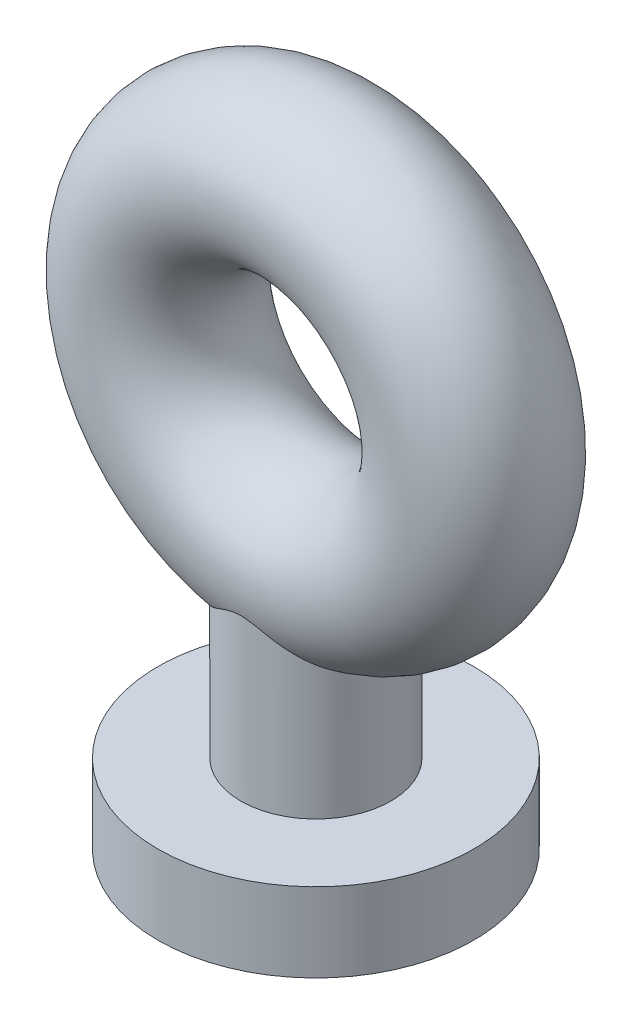
ISO-10303-21;
HEADER;
FILE_DESCRIPTION(('STEP AP214'),'2;1');
FILE_NAME('part.step','',(''),(''),'','','');
FILE_SCHEMA(('AUTOMOTIVE_DESIGN { 1 0 10303 214 1 1 1 1 }'));
ENDSEC;
DATA;
#1=APPLICATION_CONTEXT('core data for automotive mechanical design processes');
#2=APPLICATION_PROTOCOL_DEFINITION('international standard','automotive_design',2000,#1);
#3=PRODUCT_CONTEXT('',#1,'mechanical');
#4=PRODUCT('Part','Part','',(#3));
#5=PRODUCT_RELATED_PRODUCT_CATEGORY('part','',(#4));
#6=PRODUCT_DEFINITION_FORMATION('','',#4);
#7=PRODUCT_DEFINITION_CONTEXT('part definition',#1,'design');
#8=PRODUCT_DEFINITION('design','',#6,#7);
#9=PRODUCT_DEFINITION_SHAPE('','',#8);
#10=(LENGTH_UNIT() NAMED_UNIT(*) SI_UNIT(.MILLI.,.METRE.));
#11=(NAMED_UNIT(*) PLANE_ANGLE_UNIT() SI_UNIT($,.RADIAN.));
#12=(NAMED_UNIT(*) SI_UNIT($,.STERADIAN.) SOLID_ANGLE_UNIT());
#13=UNCERTAINTY_MEASURE_WITH_UNIT(LENGTH_MEASURE(1.E-05),#10,'distance_accuracy_value','');
#14=(GEOMETRIC_REPRESENTATION_CONTEXT(3) GLOBAL_UNCERTAINTY_ASSIGNED_CONTEXT((#13)) GLOBAL_UNIT_ASSIGNED_CONTEXT((#10,
#11,#12)) REPRESENTATION_CONTEXT('',''));
#15=CARTESIAN_POINT('',(0.,0.,0.));
#16=DIRECTION('',(0.,0.,1.));
#17=DIRECTION('',(1.,0.,0.));
#18=AXIS2_PLACEMENT_3D('',#15,#16,#17);
#19=CARTESIAN_POINT('',(0.,0.,0.));
#20=DIRECTION('',(0.,1.,0.));
#21=DIRECTION('',(0.,0.,1.));
#22=AXIS2_PLACEMENT_3D('',#19,#20,#21);
#23=CYLINDRICAL_SURFACE('',#22,0.95);
#24=CARTESIAN_POINT('',(0.,-4.34561065502644,0.));
#25=DIRECTION('',(0.,1.,0.));
#26=DIRECTION('',(0.,0.,1.));
#27=AXIS2_PLACEMENT_3D('',#24,#25,#26);
#28=CIRCLE('',#27,0.95);
#29=CARTESIAN_POINT('',(0.,-4.34561065502644,0.95));
#30=VERTEX_POINT('',#29);
#31=EDGE_CURVE('E66',#30,#30,#28,.T.);
#32=ORIENTED_EDGE('',*,*,#31,.T.);
#33=EDGE_LOOP('',(#32));
#34=FACE_BOUND('',#33,.T.);
#35=CARTESIAN_POINT('',(-0.686107709889865,-2.66697916564498,-0.657081585827656));
#36=CARTESIAN_POINT('',(-0.718537566607442,-2.68911585756236,-0.62321740716849));
#37=CARTESIAN_POINT('',(-0.748933624272086,-2.709846643404,-0.58645768139276));
#38=CARTESIAN_POINT('',(-0.804545566993137,-2.74766569107918,-0.507481258633035));
#39=CARTESIAN_POINT('',(-0.829760471885721,-2.76475326371729,-0.465263531567923));
#40=CARTESIAN_POINT('',(-0.873917071789901,-2.79458444290419,-0.375856493314437));
#41=CARTESIAN_POINT('',(-0.892818750301128,-2.80730035394375,-0.328637877621803));
#42=CARTESIAN_POINT('',(-0.922965017709951,-2.82753746176673,-0.230762976150301));
#43=CARTESIAN_POINT('',(-0.934215061369649,-2.83506235921848,-0.180109167670075));
#44=CARTESIAN_POINT('',(-0.947611692614304,-2.84401752924975,-0.0820978358374224));
#45=CARTESIAN_POINT('',(-0.950529917833294,-2.84596446469983,-0.034891980640852));
#46=CARTESIAN_POINT('',(-0.949312268133808,-2.84515147387259,0.0593801343468794));
#47=CARTESIAN_POINT('',(-0.94517853724194,-2.84239297820113,0.106446432210107));
#48=CARTESIAN_POINT('',(-0.93052733528911,-2.83259435208319,0.19642931015539));
#49=CARTESIAN_POINT('',(-0.920370112695916,-2.82579580197874,0.239432243088445));
#50=CARTESIAN_POINT('',(-0.894501131004106,-2.80842944054598,0.322922066097443));
#51=CARTESIAN_POINT('',(-0.878788485188182,-2.79786102749646,0.363408553302471));
#52=CARTESIAN_POINT('',(-0.841601052676448,-2.77276158488804,0.442981243326131));
#53=CARTESIAN_POINT('',(-0.819877221924564,-2.75805869394902,0.481895931285567));
#54=CARTESIAN_POINT('',(-0.77197775437424,-2.72553240879966,0.555407176759852));
#55=CARTESIAN_POINT('',(-0.745801675436277,-2.70770870466547,0.590003304819153));
#56=CARTESIAN_POINT('',(-0.686149858018138,-2.66701357329722,0.658814829395224));
#57=CARTESIAN_POINT('',(-0.65216670443968,-2.6437864489379,0.692378328853285));
#58=CARTESIAN_POINT('',(-0.580549306918772,-2.59501396118295,0.753447126679248));
#59=CARTESIAN_POINT('',(-0.542908518304331,-2.56946444777049,0.780941266475152));
#60=CARTESIAN_POINT('',(-0.457147579908317,-2.51208702437647,0.834599060964194));
#61=CARTESIAN_POINT('',(-0.408402536433583,-2.47999512268415,0.859495054736874));
#62=CARTESIAN_POINT('',(-0.332058078263538,-2.4330660717982,0.890499007206581));
#63=CARTESIAN_POINT('',(-0.306068795850057,-2.41762274018641,0.899777718251571));
#64=CARTESIAN_POINT('',(-0.252738055109097,-2.38800945576208,0.916188939007451));
#65=CARTESIAN_POINT('',(-0.225398833046407,-2.37383749974889,0.923324868103249));
#66=CARTESIAN_POINT('',(-0.174304106935673,-2.35073319964663,0.934164805276011));
#67=CARTESIAN_POINT('',(-0.150858719197372,-2.34131702906078,0.938263699218337));
#68=CARTESIAN_POINT('',(-0.102733743757806,-2.32582300358585,0.944736814862489));
#69=CARTESIAN_POINT('',(-0.0780628745748964,-2.31972446470495,0.947121752996518));
#70=CARTESIAN_POINT('',(-0.0329336264870515,-2.3132154376222,0.949640266422268));
#71=CARTESIAN_POINT('',(-0.0126331849692011,-2.31190358363882,0.950131791027877));
#72=CARTESIAN_POINT('',(0.0278935476821042,-2.31275746191911,0.949806924307897));
#73=CARTESIAN_POINT('',(0.0481197693875242,-2.314925882471,0.948989521921514));
#74=CARTESIAN_POINT('',(0.0950063807282495,-2.32352392858396,0.945625583909768));
#75=CARTESIAN_POINT('',(0.121388094779943,-2.3311977162213,0.94256623098359));
#76=CARTESIAN_POINT('',(0.172706872358861,-2.34985671198843,0.934534785433899));
#77=CARTESIAN_POINT('',(0.197634437156338,-2.36086129476586,0.929551453317192));
#78=CARTESIAN_POINT('',(0.248349617539811,-2.38563023051673,0.917365662539067));
#79=CARTESIAN_POINT('',(0.274020232020431,-2.39955214113389,0.910006646308973));
#80=CARTESIAN_POINT('',(0.324201981170281,-2.42832082503176,0.893359700895082));
#81=CARTESIAN_POINT('',(0.348711921925365,-2.44316851574397,0.884069836305237));
#82=CARTESIAN_POINT('',(0.420782987170241,-2.4880939678893,0.853331951435133));
#83=CARTESIAN_POINT('',(0.466907877644475,-2.51856665439152,0.829010072969224));
#84=CARTESIAN_POINT('',(0.559820122043784,-2.58083537287273,0.769694428223354));
#85=CARTESIAN_POINT('',(0.606200630870285,-2.61245240465935,0.733868764574627));
#86=CARTESIAN_POINT('',(0.692824048253674,-2.67155473053028,0.652686300022467));
#87=CARTESIAN_POINT('',(0.733079595183192,-2.69904853084541,0.607349597483811));
#88=CARTESIAN_POINT('',(0.796324109695874,-2.74208489668164,0.520105583081177));
#89=CARTESIAN_POINT('',(0.821119872749063,-2.75890073983021,0.480132201365907));
#90=CARTESIAN_POINT('',(0.86494586277568,-2.78853383868721,0.395757254936515));
#91=CARTESIAN_POINT('',(0.88397851996293,-2.80135277989615,0.351357567256267));
#92=CARTESIAN_POINT('',(0.915339581250593,-2.82242650242287,0.258932874995945));
#93=CARTESIAN_POINT('',(0.927632631071112,-2.83065721878391,0.210890229639261));
#94=CARTESIAN_POINT('',(0.944576988294849,-2.84199169683335,0.112886150105302));
#95=CARTESIAN_POINT('',(0.949231497026413,-2.84509760634187,0.0629255287447833));
#96=CARTESIAN_POINT('',(0.950531281660707,-2.84596531859667,-0.0325672228778721));
#97=CARTESIAN_POINT('',(0.9478683429508,-2.8441887086632,-0.0780876497965773));
#98=CARTESIAN_POINT('',(0.936139760638801,-2.83634928015792,-0.167907199337748));
#99=CARTESIAN_POINT('',(0.92707494590178,-2.83028701645911,-0.212206479293422));
#100=CARTESIAN_POINT('',(0.903172229014971,-2.81425546266319,-0.297887147397901));
#101=CARTESIAN_POINT('',(0.888402228415573,-2.80433211631884,-0.339296331717671));
#102=CARTESIAN_POINT('',(0.853779386089171,-2.78099058911118,-0.418861450588534));
#103=CARTESIAN_POINT('',(0.833925436404145,-2.76757164643258,-0.45701667357622));
#104=CARTESIAN_POINT('',(0.78802969386382,-2.73644666900796,-0.53256648242481));
#105=CARTESIAN_POINT('',(0.761603201103364,-2.71847162958032,-0.569615076686188));
#106=CARTESIAN_POINT('',(0.704662231442675,-2.67965185071339,-0.63871670085388));
#107=CARTESIAN_POINT('',(0.674145545881099,-2.65880556065958,-0.670767011366385));
#108=CARTESIAN_POINT('',(0.604774037047056,-2.61148681444532,-0.734370935053981));
#109=CARTESIAN_POINT('',(0.565364143147593,-2.5846462257675,-0.765041633791913));
#110=CARTESIAN_POINT('',(0.483082729811177,-2.52933035172843,-0.819495889955601));
#111=CARTESIAN_POINT('',(0.44020966369474,-2.50085433763272,-0.84327634815584));
#112=CARTESIAN_POINT('',(0.364330504970579,-2.45268595555276,-0.878038724732465));
#113=CARTESIAN_POINT('',(0.33215579196566,-2.43288631265247,-0.890725820484923));
#114=CARTESIAN_POINT('',(0.265757628554085,-2.39480970091007,-0.91274293080887));
#115=CARTESIAN_POINT('',(0.231535453340861,-2.37653180092346,-0.922075010067865));
#116=CARTESIAN_POINT('',(0.17459131656142,-2.3509131037208,-0.934071328974879));
#117=CARTESIAN_POINT('',(0.152783220978903,-2.34213090276924,-0.937907597991207));
#118=CARTESIAN_POINT('',(0.108056517696482,-2.32737405135911,-0.944102670472761));
#119=CARTESIAN_POINT('',(0.0851422382433093,-2.32138930418871,-0.946466797696264));
#120=CARTESIAN_POINT('',(0.0421954911207585,-2.31420215449543,-0.949265142345696));
#121=CARTESIAN_POINT('',(0.0222876901518615,-2.31238833402715,-0.949947399555592));
#122=CARTESIAN_POINT('',(-0.0175430524761697,-2.31212705526616,-0.950046676352715));
#123=CARTESIAN_POINT('',(-0.0374659785268291,-2.31367763368445,-0.949464433836329));
#124=CARTESIAN_POINT('',(-0.0828215436415344,-2.32071545130531,-0.946733973930807));
#125=CARTESIAN_POINT('',(-0.108052963332829,-2.32727170657965,-0.944157204763681));
#126=CARTESIAN_POINT('',(-0.157223051564801,-2.34370817933205,-0.937232896542781));
#127=CARTESIAN_POINT('',(-0.181152741465283,-2.35360874060347,-0.932874484603572));
#128=CARTESIAN_POINT('',(-0.229531457925854,-2.37603007373635,-0.922210830958316));
#129=CARTESIAN_POINT('',(-0.253886556734947,-2.38869102640573,-0.915784824860382));
#130=CARTESIAN_POINT('',(-0.301511158657324,-2.41505181474435,-0.901227386574602));
#131=CARTESIAN_POINT('',(-0.324779443659983,-2.42875277297033,-0.893094094381388));
#132=CARTESIAN_POINT('',(-0.393218569955852,-2.47041518123862,-0.86619096197211));
#133=CARTESIAN_POINT('',(-0.437073704434972,-2.4989628445536,-0.8449064452122));
#134=CARTESIAN_POINT('',(-0.516655572466352,-2.55177574707213,-0.798393334811907));
#135=CARTESIAN_POINT('',(-0.552737605492107,-2.5761565272753,-0.773897449215022));
#136=CARTESIAN_POINT('',(-0.621873929286447,-2.62311675046395,-0.719517343842048));
#137=CARTESIAN_POINT('',(-0.654930667972384,-2.64569764788088,-0.689637539643686));
#138=CARTESIAN_POINT('',(-0.686107709889865,-2.66697916564498,-0.657081585827656));
#139=B_SPLINE_CURVE_WITH_KNOTS('',3,(#35,#36,#37,#38,#39,#40,#41,#42,#43,#44,#45,#46,#47,#48,
#49,#50,#51,#52,#53,#54,#55,#56,#57,#58,#59,#60,#61,#62,#63,#64,#65,#66,#67,#68,#69,#70,#71,#72,
#73,#74,#75,#76,#77,#78,#79,#80,#81,#82,#83,#84,#85,#86,#87,#88,#89,#90,#91,#92,#93,#94,#95,#96,
#97,#98,#99,#100,#101,#102,#103,#104,#105,#106,#107,#108,#109,#110,#111,#112,#113,#114,#115,
#116,#117,#118,#119,#120,#121,#122,#123,#124,#125,#126,#127,#128,#129,#130,#131,#132,#133,#134,
#135,#136,#137,#138),.UNSPECIFIED.,.T.,.F.,(4,2,2,2,2,2,2,2,2,2,2,2,2,2,2,2,2,2,2,2,2,2,2,2,2,2,
2,2,2,2,2,2,2,2,2,2,2,2,2,2,2,2,2,2,2,2,2,2,2,2,2,4),(0.,0.155414593700593,0.310858561520415,
0.46726990080216,0.623569619045127,0.764833349134726,0.906054138057857,1.03957722827315,
1.17312164012668,1.31335024058479,1.45359277486736,1.61233018112952,1.77135704090581,
1.96089917914539,2.05569301372248,2.15033476537958,2.22693802253045,2.30305805267902,
2.36377291126995,2.4245346907589,2.50697218941158,2.58989874138626,2.68011451335322,
2.77042115395856,2.9509560467706,3.14979228779157,3.34821251336579,3.49746587251359,
3.64665620586651,3.79662184306225,3.94652461328408,4.08275505857397,4.2189678690391,
4.35360712277879,4.48827574380493,4.63449605601793,4.78079564619079,4.95027015382355,
5.11982077305467,5.23923212697527,5.35856986847866,5.42988535721948,5.50094142423115,
5.56064208758023,5.62030792208319,5.69842329518862,5.77702267646738,5.86147261487843,
5.94601503939041,6.11492788578724,6.26446066130362,6.41387135234024),.UNSPECIFIED.);
#140=CARTESIAN_POINT('',(-0.686107709889865,-2.66697916564498,-0.657081585827656));
#141=VERTEX_POINT('',#140);
#142=EDGE_CURVE('E10',#141,#141,#139,.T.);
#143=ORIENTED_EDGE('',*,*,#142,.F.);
#144=EDGE_LOOP('',(#143));
#145=FACE_BOUND('',#144,.T.);
#146=ADVANCED_FACE('F43',(#34,#145),#23,.T.);
#147=CARTESIAN_POINT('',(0.,-5.34561065502644,0.));
#148=DIRECTION('',(0.,-1.,0.));
#149=DIRECTION('',(0.,0.,-1.));
#150=AXIS2_PLACEMENT_3D('',#147,#148,#149);
#151=PLANE('',#150);
#152=CARTESIAN_POINT('',(0.,-5.34561065502644,0.));
#153=DIRECTION('',(0.,1.,0.));
#154=DIRECTION('',(0.,0.,1.));
#155=AXIS2_PLACEMENT_3D('',#152,#153,#154);
#156=CIRCLE('',#155,2.);
#157=CARTESIAN_POINT('',(0.,-5.34561065502644,2.));
#158=VERTEX_POINT('',#157);
#159=EDGE_CURVE('E56',#158,#158,#156,.T.);
#160=ORIENTED_EDGE('',*,*,#159,.F.);
#161=EDGE_LOOP('',(#160));
#162=FACE_BOUND('',#161,.T.);
#163=ADVANCED_FACE('F84',(#162),#151,.T.);
#164=CARTESIAN_POINT('',(0.,0.,0.));
#165=DIRECTION('',(0.,1.,0.));
#166=DIRECTION('',(0.,0.,1.));
#167=AXIS2_PLACEMENT_3D('',#164,#165,#166);
#168=CYLINDRICAL_SURFACE('',#167,2.);
#169=ORIENTED_EDGE('',*,*,#159,.T.);
#170=EDGE_LOOP('',(#169));
#171=FACE_BOUND('',#170,.T.);
#172=CARTESIAN_POINT('',(0.,-4.34561065502644,0.));
#173=DIRECTION('',(0.,1.,0.));
#174=DIRECTION('',(0.,0.,1.));
#175=AXIS2_PLACEMENT_3D('',#172,#173,#174);
#176=CIRCLE('',#175,2.);
#177=CARTESIAN_POINT('',(0.,-4.34561065502644,2.));
#178=VERTEX_POINT('',#177);
#179=EDGE_CURVE('E61',#178,#178,#176,.T.);
#180=ORIENTED_EDGE('',*,*,#179,.F.);
#181=EDGE_LOOP('',(#180));
#182=FACE_BOUND('',#181,.T.);
#183=ADVANCED_FACE('F77',(#171,#182),#168,.T.);
#184=CARTESIAN_POINT('',(0.,-4.34561065502644,0.));
#185=DIRECTION('',(0.,1.,0.));
#186=DIRECTION('',(0.,0.,1.));
#187=AXIS2_PLACEMENT_3D('',#184,#185,#186);
#188=PLANE('',#187);
#189=ORIENTED_EDGE('',*,*,#179,.T.);
#190=EDGE_LOOP('',(#189));
#191=FACE_BOUND('',#190,.T.);
#192=ORIENTED_EDGE('',*,*,#31,.F.);
#193=EDGE_LOOP('',(#192));
#194=FACE_BOUND('',#193,.T.);
#195=ADVANCED_FACE('F75',(#191,#194),#188,.T.);
#196=CARTESIAN_POINT('',(0.,0.,0.));
#197=DIRECTION('',(0.,0.,-1.));
#198=DIRECTION('',(-1.,0.,0.));
#199=AXIS2_PLACEMENT_3D('',#196,#197,#198);
#200=TOROIDAL_SURFACE('',#199,2.,1.);
#201=ORIENTED_EDGE('',*,*,#142,.T.);
#202=EDGE_LOOP('',(#201));
#203=FACE_BOUND('',#202,.T.);
#204=ADVANCED_FACE('F45',(#203),#200,.T.);
#205=CLOSED_SHELL('',(#146,#163,#183,#195,#204));
#206=MANIFOLD_SOLID_BREP('B2',#205);
#207=ADVANCED_BREP_SHAPE_REPRESENTATION('',(#18,#206),#14);
#208=SHAPE_DEFINITION_REPRESENTATION(#9,#207);
ENDSEC;
END-ISO-10303-21;
